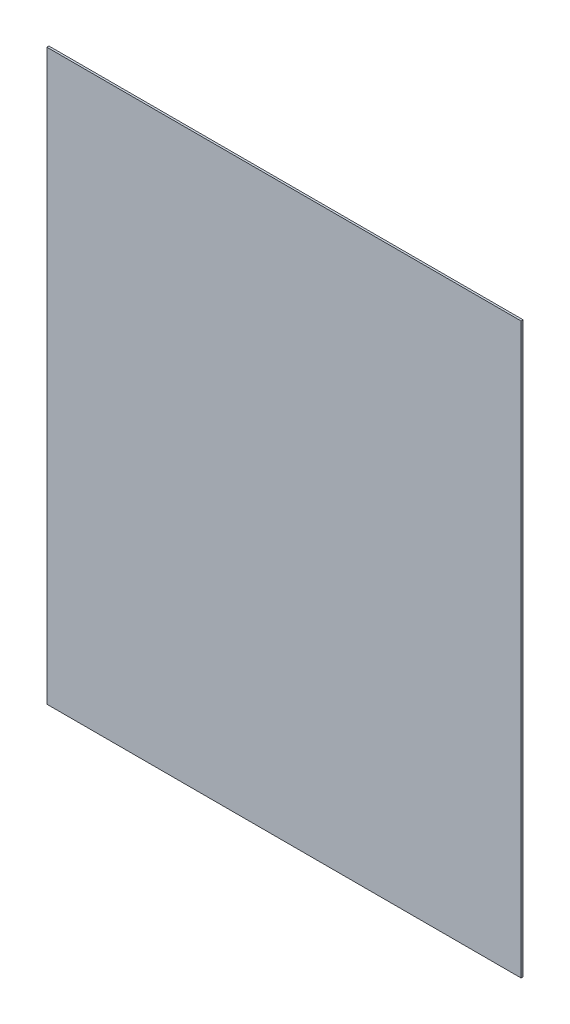
ISO-10303-21;
HEADER;
FILE_DESCRIPTION(('STEP AP214'),'2;1');
FILE_NAME('part.step','',(''),(''),'','','');
FILE_SCHEMA(('AUTOMOTIVE_DESIGN { 1 0 10303 214 1 1 1 1 }'));
ENDSEC;
DATA;
#1=APPLICATION_CONTEXT('core data for automotive mechanical design processes');
#2=APPLICATION_PROTOCOL_DEFINITION('international standard','automotive_design',2000,#1);
#3=PRODUCT_CONTEXT('',#1,'mechanical');
#4=PRODUCT('Part','Part','',(#3));
#5=PRODUCT_RELATED_PRODUCT_CATEGORY('part','',(#4));
#6=PRODUCT_DEFINITION_FORMATION('','',#4);
#7=PRODUCT_DEFINITION_CONTEXT('part definition',#1,'design');
#8=PRODUCT_DEFINITION('design','',#6,#7);
#9=PRODUCT_DEFINITION_SHAPE('','',#8);
#10=(LENGTH_UNIT() NAMED_UNIT(*) SI_UNIT(.MILLI.,.METRE.));
#11=(NAMED_UNIT(*) PLANE_ANGLE_UNIT() SI_UNIT($,.RADIAN.));
#12=(NAMED_UNIT(*) SI_UNIT($,.STERADIAN.) SOLID_ANGLE_UNIT());
#13=UNCERTAINTY_MEASURE_WITH_UNIT(LENGTH_MEASURE(1.E-05),#10,'distance_accuracy_value','');
#14=(GEOMETRIC_REPRESENTATION_CONTEXT(3) GLOBAL_UNCERTAINTY_ASSIGNED_CONTEXT((#13)) GLOBAL_UNIT_ASSIGNED_CONTEXT((#10,
#11,#12)) REPRESENTATION_CONTEXT('',''));
#15=CARTESIAN_POINT('',(0.,0.,0.));
#16=DIRECTION('',(0.,0.,1.));
#17=DIRECTION('',(1.,0.,0.));
#18=AXIS2_PLACEMENT_3D('',#15,#16,#17);
#19=CARTESIAN_POINT('',(-26.9240000000001,865.124,-3.302));
#20=DIRECTION('',(1.,0.,0.));
#21=DIRECTION('',(0.,1.,0.));
#22=AXIS2_PLACEMENT_3D('',#19,#20,#21);
#23=PLANE('',#22);
#24=DIRECTION('',(0.,1.,0.));
#25=VECTOR('',#24,1.);
#26=CARTESIAN_POINT('',(-26.9240000000001,865.124,0.));
#27=LINE('',#26,#25);
#28=CARTESIAN_POINT('',(-26.9240000000001,865.124,0.));
#29=VERTEX_POINT('',#28);
#30=CARTESIAN_POINT('',(-26.9240000000001,1779.524,0.));
#31=VERTEX_POINT('',#30);
#32=EDGE_CURVE('E97',#29,#31,#27,.T.);
#33=ORIENTED_EDGE('',*,*,#32,.F.);
#34=DIRECTION('',(0.,0.,1.));
#35=VECTOR('',#34,1.);
#36=CARTESIAN_POINT('',(-26.9240000000001,865.124,-3.302));
#37=LINE('',#36,#35);
#38=CARTESIAN_POINT('',(-26.9240000000001,865.124,-3.302));
#39=VERTEX_POINT('',#38);
#40=EDGE_CURVE('E11',#39,#29,#37,.T.);
#41=ORIENTED_EDGE('',*,*,#40,.F.);
#42=DIRECTION('',(0.,1.,0.));
#43=VECTOR('',#42,1.);
#44=CARTESIAN_POINT('',(-26.9240000000001,865.124,-3.302));
#45=LINE('',#44,#43);
#46=CARTESIAN_POINT('',(-26.9240000000001,1779.524,-3.302));
#47=VERTEX_POINT('',#46);
#48=EDGE_CURVE('E91',#39,#47,#45,.T.);
#49=ORIENTED_EDGE('',*,*,#48,.T.);
#50=DIRECTION('',(0.,0.,1.));
#51=VECTOR('',#50,1.);
#52=CARTESIAN_POINT('',(-26.9240000000001,1779.524,-3.302));
#53=LINE('',#52,#51);
#54=EDGE_CURVE('E36',#47,#31,#53,.T.);
#55=ORIENTED_EDGE('',*,*,#54,.T.);
#56=EDGE_LOOP('',(#33,#41,#49,#55));
#57=FACE_BOUND('',#56,.T.);
#58=ADVANCED_FACE('F33',(#57),#23,.T.);
#59=CARTESIAN_POINT('',(-26.9240000000001,865.124,-3.302));
#60=DIRECTION('',(0.,-1.,0.));
#61=DIRECTION('',(1.,0.,0.));
#62=AXIS2_PLACEMENT_3D('',#59,#60,#61);
#63=PLANE('',#62);
#64=DIRECTION('',(1.,0.,0.));
#65=VECTOR('',#64,1.);
#66=CARTESIAN_POINT('',(-26.9240000000001,865.124,0.));
#67=LINE('',#66,#65);
#68=CARTESIAN_POINT('',(-788.924,865.124,0.));
#69=VERTEX_POINT('',#68);
#70=EDGE_CURVE('E93',#69,#29,#67,.T.);
#71=ORIENTED_EDGE('',*,*,#70,.F.);
#72=DIRECTION('',(0.,0.,1.));
#73=VECTOR('',#72,1.);
#74=CARTESIAN_POINT('',(-788.924,865.124,-3.302));
#75=LINE('',#74,#73);
#76=CARTESIAN_POINT('',(-788.924,865.124,-3.302));
#77=VERTEX_POINT('',#76);
#78=EDGE_CURVE('E42',#77,#69,#75,.T.);
#79=ORIENTED_EDGE('',*,*,#78,.F.);
#80=DIRECTION('',(1.,0.,0.));
#81=VECTOR('',#80,1.);
#82=CARTESIAN_POINT('',(-26.9240000000001,865.124,-3.302));
#83=LINE('',#82,#81);
#84=EDGE_CURVE('E88',#77,#39,#83,.T.);
#85=ORIENTED_EDGE('',*,*,#84,.T.);
#86=ORIENTED_EDGE('',*,*,#40,.T.);
#87=EDGE_LOOP('',(#71,#79,#85,#86));
#88=FACE_BOUND('',#87,.T.);
#89=ADVANCED_FACE('F107',(#88),#63,.T.);
#90=CARTESIAN_POINT('',(-788.924,865.124,-3.302));
#91=DIRECTION('',(-1.,0.,0.));
#92=DIRECTION('',(0.,-1.,0.));
#93=AXIS2_PLACEMENT_3D('',#90,#91,#92);
#94=PLANE('',#93);
#95=DIRECTION('',(0.,-1.,0.));
#96=VECTOR('',#95,1.);
#97=CARTESIAN_POINT('',(-788.924,865.124,0.));
#98=LINE('',#97,#96);
#99=CARTESIAN_POINT('',(-788.924,1779.524,0.));
#100=VERTEX_POINT('',#99);
#101=EDGE_CURVE('E83',#100,#69,#98,.T.);
#102=ORIENTED_EDGE('',*,*,#101,.F.);
#103=DIRECTION('',(0.,0.,1.));
#104=VECTOR('',#103,1.);
#105=CARTESIAN_POINT('',(-788.924,1779.524,-3.302));
#106=LINE('',#105,#104);
#107=CARTESIAN_POINT('',(-788.924,1779.524,-3.302));
#108=VERTEX_POINT('',#107);
#109=EDGE_CURVE('E78',#108,#100,#106,.T.);
#110=ORIENTED_EDGE('',*,*,#109,.F.);
#111=DIRECTION('',(0.,-1.,0.));
#112=VECTOR('',#111,1.);
#113=CARTESIAN_POINT('',(-788.924,865.124,-3.302));
#114=LINE('',#113,#112);
#115=EDGE_CURVE('E81',#108,#77,#114,.T.);
#116=ORIENTED_EDGE('',*,*,#115,.T.);
#117=ORIENTED_EDGE('',*,*,#78,.T.);
#118=EDGE_LOOP('',(#102,#110,#116,#117));
#119=FACE_BOUND('',#118,.T.);
#120=ADVANCED_FACE('F80',(#119),#94,.T.);
#121=CARTESIAN_POINT('',(-26.9240000000001,1779.524,-3.302));
#122=DIRECTION('',(0.,1.,0.));
#123=DIRECTION('',(0.,0.,1.));
#124=AXIS2_PLACEMENT_3D('',#121,#122,#123);
#125=PLANE('',#124);
#126=DIRECTION('',(-1.,0.,0.));
#127=VECTOR('',#126,1.);
#128=CARTESIAN_POINT('',(-26.9240000000001,1779.524,0.));
#129=LINE('',#128,#127);
#130=EDGE_CURVE('E100',#31,#100,#129,.T.);
#131=ORIENTED_EDGE('',*,*,#130,.F.);
#132=ORIENTED_EDGE('',*,*,#54,.F.);
#133=DIRECTION('',(-1.,0.,0.));
#134=VECTOR('',#133,1.);
#135=CARTESIAN_POINT('',(-26.9240000000001,1779.524,-3.302));
#136=LINE('',#135,#134);
#137=EDGE_CURVE('E87',#47,#108,#136,.T.);
#138=ORIENTED_EDGE('',*,*,#137,.T.);
#139=ORIENTED_EDGE('',*,*,#109,.T.);
#140=EDGE_LOOP('',(#131,#132,#138,#139));
#141=FACE_BOUND('',#140,.T.);
#142=ADVANCED_FACE('F90',(#141),#125,.T.);
#143=CARTESIAN_POINT('',(0.,0.,-3.302));
#144=DIRECTION('',(0.,0.,1.));
#145=DIRECTION('',(1.,0.,0.));
#146=AXIS2_PLACEMENT_3D('',#143,#144,#145);
#147=PLANE('',#146);
#148=ORIENTED_EDGE('',*,*,#48,.F.);
#149=ORIENTED_EDGE('',*,*,#84,.F.);
#150=ORIENTED_EDGE('',*,*,#115,.F.);
#151=ORIENTED_EDGE('',*,*,#137,.F.);
#152=EDGE_LOOP('',(#148,#149,#150,#151));
#153=FACE_BOUND('',#152,.T.);
#154=ADVANCED_FACE('F86',(#153),#147,.F.);
#155=CARTESIAN_POINT('',(0.,0.,0.));
#156=DIRECTION('',(0.,0.,1.));
#157=DIRECTION('',(1.,0.,0.));
#158=AXIS2_PLACEMENT_3D('',#155,#156,#157);
#159=PLANE('',#158);
#160=ORIENTED_EDGE('',*,*,#32,.T.);
#161=ORIENTED_EDGE('',*,*,#130,.T.);
#162=ORIENTED_EDGE('',*,*,#101,.T.);
#163=ORIENTED_EDGE('',*,*,#70,.T.);
#164=EDGE_LOOP('',(#160,#161,#162,#163));
#165=FACE_BOUND('',#164,.T.);
#166=ADVANCED_FACE('F106',(#165),#159,.T.);
#167=CLOSED_SHELL('',(#58,#89,#120,#142,#154,#166));
#168=MANIFOLD_SOLID_BREP('B2',#167);
#169=ADVANCED_BREP_SHAPE_REPRESENTATION('',(#18,#168),#14);
#170=SHAPE_DEFINITION_REPRESENTATION(#9,#169);
ENDSEC;
END-ISO-10303-21;
